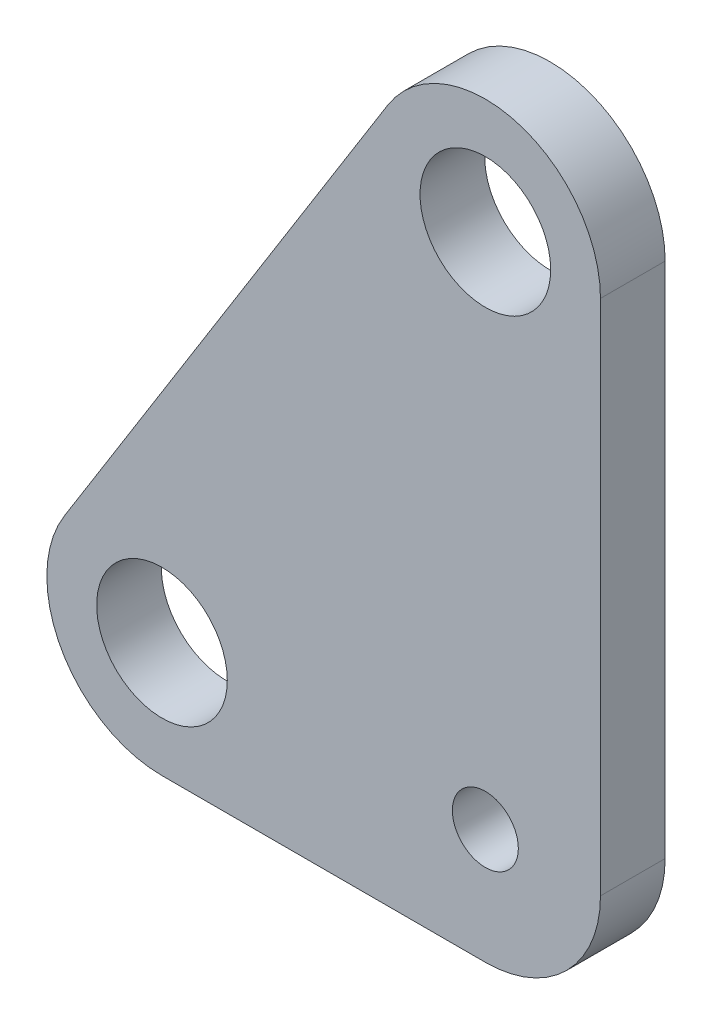
ISO-10303-21;
HEADER;
FILE_DESCRIPTION(('STEP AP214'),'2;1');
FILE_NAME('part.step','',(''),(''),'','','');
FILE_SCHEMA(('AUTOMOTIVE_DESIGN { 1 0 10303 214 1 1 1 1 }'));
ENDSEC;
DATA;
#1=APPLICATION_CONTEXT('core data for automotive mechanical design processes');
#2=APPLICATION_PROTOCOL_DEFINITION('international standard','automotive_design',2000,#1);
#3=PRODUCT_CONTEXT('',#1,'mechanical');
#4=PRODUCT('Part','Part','',(#3));
#5=PRODUCT_RELATED_PRODUCT_CATEGORY('part','',(#4));
#6=PRODUCT_DEFINITION_FORMATION('','',#4);
#7=PRODUCT_DEFINITION_CONTEXT('part definition',#1,'design');
#8=PRODUCT_DEFINITION('design','',#6,#7);
#9=PRODUCT_DEFINITION_SHAPE('','',#8);
#10=(LENGTH_UNIT() NAMED_UNIT(*) SI_UNIT(.MILLI.,.METRE.));
#11=(NAMED_UNIT(*) PLANE_ANGLE_UNIT() SI_UNIT($,.RADIAN.));
#12=(NAMED_UNIT(*) SI_UNIT($,.STERADIAN.) SOLID_ANGLE_UNIT());
#13=UNCERTAINTY_MEASURE_WITH_UNIT(LENGTH_MEASURE(1.E-05),#10,'distance_accuracy_value','');
#14=(GEOMETRIC_REPRESENTATION_CONTEXT(3) GLOBAL_UNCERTAINTY_ASSIGNED_CONTEXT((#13)) GLOBAL_UNIT_ASSIGNED_CONTEXT((#10,
#11,#12)) REPRESENTATION_CONTEXT('',''));
#15=CARTESIAN_POINT('',(0.,0.,0.));
#16=DIRECTION('',(0.,0.,1.));
#17=DIRECTION('',(1.,0.,0.));
#18=AXIS2_PLACEMENT_3D('',#15,#16,#17);
#19=CARTESIAN_POINT('',(-31.75,0.,6.35));
#20=DIRECTION('',(0.,0.,1.));
#21=DIRECTION('',(1.,0.,0.));
#22=AXIS2_PLACEMENT_3D('',#19,#20,#21);
#23=PLANE('',#22);
#24=CARTESIAN_POINT('',(-31.75,0.,6.35));
#25=DIRECTION('',(0.,0.,1.));
#26=DIRECTION('',(1.,0.,0.));
#27=AXIS2_PLACEMENT_3D('',#24,#25,#26);
#28=CIRCLE('',#27,6.4135);
#29=CARTESIAN_POINT('',(-25.3365,0.,6.35));
#30=VERTEX_POINT('',#29);
#31=EDGE_CURVE('E211',#30,#30,#28,.T.);
#32=ORIENTED_EDGE('',*,*,#31,.F.);
#33=EDGE_LOOP('',(#32));
#34=FACE_BOUND('',#33,.T.);
#35=CARTESIAN_POINT('',(-31.75,0.,6.35));
#36=DIRECTION('',(0.,0.,1.));
#37=DIRECTION('',(1.,0.,0.));
#38=AXIS2_PLACEMENT_3D('',#35,#36,#37);
#39=CIRCLE('',#38,11.303);
#40=CARTESIAN_POINT('',(-41.3349248301695,5.99057801885595,6.35));
#41=VERTEX_POINT('',#40);
#42=CARTESIAN_POINT('',(-31.75,-11.303,6.35));
#43=VERTEX_POINT('',#42);
#44=EDGE_CURVE('E150',#41,#43,#39,.T.);
#45=ORIENTED_EDGE('',*,*,#44,.T.);
#46=DIRECTION('',(1.,0.,0.));
#47=VECTOR('',#46,1.);
#48=CARTESIAN_POINT('',(-31.75,-11.303,6.35));
#49=LINE('',#48,#47);
#50=CARTESIAN_POINT('',(0.,-11.303,6.35));
#51=VERTEX_POINT('',#50);
#52=EDGE_CURVE('E98',#43,#51,#49,.T.);
#53=ORIENTED_EDGE('',*,*,#52,.T.);
#54=CARTESIAN_POINT('',(0.,0.,6.35));
#55=DIRECTION('',(0.,0.,1.));
#56=DIRECTION('',(1.,0.,0.));
#57=AXIS2_PLACEMENT_3D('',#54,#55,#56);
#58=CIRCLE('',#57,11.303);
#59=CARTESIAN_POINT('',(11.303,0.,6.35));
#60=VERTEX_POINT('',#59);
#61=EDGE_CURVE('E111',#51,#60,#58,.T.);
#62=ORIENTED_EDGE('',*,*,#61,.T.);
#63=DIRECTION('',(0.,1.,0.));
#64=VECTOR('',#63,1.);
#65=CARTESIAN_POINT('',(11.303,0.,6.35));
#66=LINE('',#65,#64);
#67=CARTESIAN_POINT('',(11.303,50.8,6.35));
#68=VERTEX_POINT('',#67);
#69=EDGE_CURVE('E105',#60,#68,#66,.T.);
#70=ORIENTED_EDGE('',*,*,#69,.T.);
#71=CARTESIAN_POINT('',(0.,50.8,6.35));
#72=DIRECTION('',(0.,0.,1.));
#73=DIRECTION('',(1.,0.,0.));
#74=AXIS2_PLACEMENT_3D('',#71,#72,#73);
#75=CIRCLE('',#74,11.303);
#76=CARTESIAN_POINT('',(-9.58492483016951,56.7905780188559,6.35));
#77=VERTEX_POINT('',#76);
#78=EDGE_CURVE('E109',#68,#77,#75,.T.);
#79=ORIENTED_EDGE('',*,*,#78,.T.);
#80=DIRECTION('',(-0.52999894000318,-0.847998304005088,0.));
#81=VECTOR('',#80,1.);
#82=CARTESIAN_POINT('',(-41.3349248301695,5.99057801885595,6.35));
#83=LINE('',#82,#81);
#84=EDGE_CURVE('E61',#77,#41,#83,.T.);
#85=ORIENTED_EDGE('',*,*,#84,.T.);
#86=EDGE_LOOP('',(#45,#53,#62,#70,#79,#85));
#87=FACE_BOUND('',#86,.T.);
#88=CARTESIAN_POINT('',(0.,0.,6.35));
#89=DIRECTION('',(0.,0.,1.));
#90=DIRECTION('',(1.,0.,0.));
#91=AXIS2_PLACEMENT_3D('',#88,#89,#90);
#92=CIRCLE('',#91,3.2385);
#93=CARTESIAN_POINT('',(3.2385,0.,6.35));
#94=VERTEX_POINT('',#93);
#95=EDGE_CURVE('E138',#94,#94,#92,.T.);
#96=ORIENTED_EDGE('',*,*,#95,.F.);
#97=EDGE_LOOP('',(#96));
#98=FACE_BOUND('',#97,.T.);
#99=CARTESIAN_POINT('',(0.,50.8,6.35));
#100=DIRECTION('',(0.,0.,1.));
#101=DIRECTION('',(1.,0.,0.));
#102=AXIS2_PLACEMENT_3D('',#99,#100,#101);
#103=CIRCLE('',#102,6.4135);
#104=CARTESIAN_POINT('',(6.4135,50.8,6.35));
#105=VERTEX_POINT('',#104);
#106=EDGE_CURVE('E200',#105,#105,#103,.T.);
#107=ORIENTED_EDGE('',*,*,#106,.F.);
#108=EDGE_LOOP('',(#107));
#109=FACE_BOUND('',#108,.T.);
#110=ADVANCED_FACE('F43',(#34,#87,#98,#109),#23,.T.);
#111=CARTESIAN_POINT('',(-31.75,0.,0.));
#112=DIRECTION('',(0.,0.,1.));
#113=DIRECTION('',(1.,0.,0.));
#114=AXIS2_PLACEMENT_3D('',#111,#112,#113);
#115=PLANE('',#114);
#116=CARTESIAN_POINT('',(-31.75,0.,0.));
#117=DIRECTION('',(0.,0.,1.));
#118=DIRECTION('',(1.,0.,0.));
#119=AXIS2_PLACEMENT_3D('',#116,#117,#118);
#120=CIRCLE('',#119,11.303);
#121=CARTESIAN_POINT('',(-41.3349248301695,5.99057801885595,0.));
#122=VERTEX_POINT('',#121);
#123=CARTESIAN_POINT('',(-31.75,-11.303,0.));
#124=VERTEX_POINT('',#123);
#125=EDGE_CURVE('E133',#122,#124,#120,.T.);
#126=ORIENTED_EDGE('',*,*,#125,.F.);
#127=DIRECTION('',(-0.52999894000318,-0.847998304005088,0.));
#128=VECTOR('',#127,1.);
#129=CARTESIAN_POINT('',(-41.3349248301695,5.99057801885595,0.));
#130=LINE('',#129,#128);
#131=CARTESIAN_POINT('',(-9.58492483016951,56.7905780188559,0.));
#132=VERTEX_POINT('',#131);
#133=EDGE_CURVE('E90',#132,#122,#130,.T.);
#134=ORIENTED_EDGE('',*,*,#133,.F.);
#135=CARTESIAN_POINT('',(0.,50.8,0.));
#136=DIRECTION('',(0.,0.,1.));
#137=DIRECTION('',(1.,0.,0.));
#138=AXIS2_PLACEMENT_3D('',#135,#136,#137);
#139=CIRCLE('',#138,11.303);
#140=CARTESIAN_POINT('',(11.303,50.8,0.));
#141=VERTEX_POINT('',#140);
#142=EDGE_CURVE('E84',#141,#132,#139,.T.);
#143=ORIENTED_EDGE('',*,*,#142,.F.);
#144=DIRECTION('',(0.,1.,0.));
#145=VECTOR('',#144,1.);
#146=CARTESIAN_POINT('',(11.303,0.,0.));
#147=LINE('',#146,#145);
#148=CARTESIAN_POINT('',(11.303,0.,0.));
#149=VERTEX_POINT('',#148);
#150=EDGE_CURVE('E120',#149,#141,#147,.T.);
#151=ORIENTED_EDGE('',*,*,#150,.F.);
#152=CARTESIAN_POINT('',(0.,0.,0.));
#153=DIRECTION('',(0.,0.,1.));
#154=DIRECTION('',(1.,0.,0.));
#155=AXIS2_PLACEMENT_3D('',#152,#153,#154);
#156=CIRCLE('',#155,11.303);
#157=CARTESIAN_POINT('',(0.,-11.303,0.));
#158=VERTEX_POINT('',#157);
#159=EDGE_CURVE('E141',#158,#149,#156,.T.);
#160=ORIENTED_EDGE('',*,*,#159,.F.);
#161=DIRECTION('',(1.,0.,0.));
#162=VECTOR('',#161,1.);
#163=CARTESIAN_POINT('',(-31.75,-11.303,0.));
#164=LINE('',#163,#162);
#165=EDGE_CURVE('E137',#124,#158,#164,.T.);
#166=ORIENTED_EDGE('',*,*,#165,.F.);
#167=EDGE_LOOP('',(#126,#134,#143,#151,#160,#166));
#168=FACE_BOUND('',#167,.T.);
#169=CARTESIAN_POINT('',(0.,0.,0.));
#170=DIRECTION('',(0.,0.,1.));
#171=DIRECTION('',(1.,0.,0.));
#172=AXIS2_PLACEMENT_3D('',#169,#170,#171);
#173=CIRCLE('',#172,3.2385);
#174=CARTESIAN_POINT('',(3.2385,0.,0.));
#175=VERTEX_POINT('',#174);
#176=EDGE_CURVE('E215',#175,#175,#173,.T.);
#177=ORIENTED_EDGE('',*,*,#176,.T.);
#178=EDGE_LOOP('',(#177));
#179=FACE_BOUND('',#178,.T.);
#180=CARTESIAN_POINT('',(-31.75,0.,0.));
#181=DIRECTION('',(0.,0.,1.));
#182=DIRECTION('',(1.,0.,0.));
#183=AXIS2_PLACEMENT_3D('',#180,#181,#182);
#184=CIRCLE('',#183,6.4135);
#185=CARTESIAN_POINT('',(-25.3365,0.,0.));
#186=VERTEX_POINT('',#185);
#187=EDGE_CURVE('E208',#186,#186,#184,.T.);
#188=ORIENTED_EDGE('',*,*,#187,.T.);
#189=EDGE_LOOP('',(#188));
#190=FACE_BOUND('',#189,.T.);
#191=CARTESIAN_POINT('',(0.,50.8,0.));
#192=DIRECTION('',(0.,0.,1.));
#193=DIRECTION('',(1.,0.,0.));
#194=AXIS2_PLACEMENT_3D('',#191,#192,#193);
#195=CIRCLE('',#194,6.4135);
#196=CARTESIAN_POINT('',(6.4135,50.8,0.));
#197=VERTEX_POINT('',#196);
#198=EDGE_CURVE('E203',#197,#197,#195,.T.);
#199=ORIENTED_EDGE('',*,*,#198,.T.);
#200=EDGE_LOOP('',(#199));
#201=FACE_BOUND('',#200,.T.);
#202=ADVANCED_FACE('F163',(#168,#179,#190,#201),#115,.F.);
#203=CARTESIAN_POINT('',(-31.75,0.,6.35));
#204=DIRECTION('',(0.,0.,-1.));
#205=DIRECTION('',(-1.,0.,0.));
#206=AXIS2_PLACEMENT_3D('',#203,#204,#205);
#207=CYLINDRICAL_SURFACE('',#206,11.303);
#208=ORIENTED_EDGE('',*,*,#125,.T.);
#209=DIRECTION('',(0.,0.,-1.));
#210=VECTOR('',#209,1.);
#211=CARTESIAN_POINT('',(-31.75,-11.303,6.35));
#212=LINE('',#211,#210);
#213=EDGE_CURVE('E11',#43,#124,#212,.T.);
#214=ORIENTED_EDGE('',*,*,#213,.F.);
#215=ORIENTED_EDGE('',*,*,#44,.F.);
#216=DIRECTION('',(0.,0.,-1.));
#217=VECTOR('',#216,1.);
#218=CARTESIAN_POINT('',(-41.3349248301695,5.99057801885595,6.35));
#219=LINE('',#218,#217);
#220=EDGE_CURVE('E129',#41,#122,#219,.T.);
#221=ORIENTED_EDGE('',*,*,#220,.T.);
#222=EDGE_LOOP('',(#208,#214,#215,#221));
#223=FACE_BOUND('',#222,.T.);
#224=ADVANCED_FACE('F45',(#223),#207,.T.);
#225=CARTESIAN_POINT('',(-31.75,-11.303,6.35));
#226=DIRECTION('',(0.,1.,0.));
#227=DIRECTION('',(0.,0.,1.));
#228=AXIS2_PLACEMENT_3D('',#225,#226,#227);
#229=PLANE('',#228);
#230=ORIENTED_EDGE('',*,*,#165,.T.);
#231=DIRECTION('',(0.,0.,-1.));
#232=VECTOR('',#231,1.);
#233=CARTESIAN_POINT('',(0.,-11.303,6.35));
#234=LINE('',#233,#232);
#235=EDGE_CURVE('E53',#51,#158,#234,.T.);
#236=ORIENTED_EDGE('',*,*,#235,.F.);
#237=ORIENTED_EDGE('',*,*,#52,.F.);
#238=ORIENTED_EDGE('',*,*,#213,.T.);
#239=EDGE_LOOP('',(#230,#236,#237,#238));
#240=FACE_BOUND('',#239,.T.);
#241=ADVANCED_FACE('F275',(#240),#229,.F.);
#242=CARTESIAN_POINT('',(0.,0.,6.35));
#243=DIRECTION('',(0.,0.,-1.));
#244=DIRECTION('',(-1.,0.,0.));
#245=AXIS2_PLACEMENT_3D('',#242,#243,#244);
#246=CYLINDRICAL_SURFACE('',#245,11.303);
#247=ORIENTED_EDGE('',*,*,#159,.T.);
#248=DIRECTION('',(0.,0.,-1.));
#249=VECTOR('',#248,1.);
#250=CARTESIAN_POINT('',(11.303,0.,6.35));
#251=LINE('',#250,#249);
#252=EDGE_CURVE('E122',#60,#149,#251,.T.);
#253=ORIENTED_EDGE('',*,*,#252,.F.);
#254=ORIENTED_EDGE('',*,*,#61,.F.);
#255=ORIENTED_EDGE('',*,*,#235,.T.);
#256=EDGE_LOOP('',(#247,#253,#254,#255));
#257=FACE_BOUND('',#256,.T.);
#258=ADVANCED_FACE('F160',(#257),#246,.T.);
#259=CARTESIAN_POINT('',(11.303,0.,6.35));
#260=DIRECTION('',(-1.,0.,0.));
#261=DIRECTION('',(0.,-1.,0.));
#262=AXIS2_PLACEMENT_3D('',#259,#260,#261);
#263=PLANE('',#262);
#264=ORIENTED_EDGE('',*,*,#150,.T.);
#265=DIRECTION('',(0.,0.,-1.));
#266=VECTOR('',#265,1.);
#267=CARTESIAN_POINT('',(11.303,50.8,6.35));
#268=LINE('',#267,#266);
#269=EDGE_CURVE('E117',#68,#141,#268,.T.);
#270=ORIENTED_EDGE('',*,*,#269,.F.);
#271=ORIENTED_EDGE('',*,*,#69,.F.);
#272=ORIENTED_EDGE('',*,*,#252,.T.);
#273=EDGE_LOOP('',(#264,#270,#271,#272));
#274=FACE_BOUND('',#273,.T.);
#275=ADVANCED_FACE('F118',(#274),#263,.F.);
#276=CARTESIAN_POINT('',(0.,50.8,6.35));
#277=DIRECTION('',(0.,0.,-1.));
#278=DIRECTION('',(-1.,0.,0.));
#279=AXIS2_PLACEMENT_3D('',#276,#277,#278);
#280=CYLINDRICAL_SURFACE('',#279,11.303);
#281=ORIENTED_EDGE('',*,*,#142,.T.);
#282=DIRECTION('',(0.,0.,-1.));
#283=VECTOR('',#282,1.);
#284=CARTESIAN_POINT('',(-9.58492483016951,56.7905780188559,6.35));
#285=LINE('',#284,#283);
#286=EDGE_CURVE('E123',#77,#132,#285,.T.);
#287=ORIENTED_EDGE('',*,*,#286,.F.);
#288=ORIENTED_EDGE('',*,*,#78,.F.);
#289=ORIENTED_EDGE('',*,*,#269,.T.);
#290=EDGE_LOOP('',(#281,#287,#288,#289));
#291=FACE_BOUND('',#290,.T.);
#292=ADVANCED_FACE('F125',(#291),#280,.T.);
#293=CARTESIAN_POINT('',(-41.3349248301695,5.99057801885595,6.35));
#294=DIRECTION('',(0.847998304005088,-0.52999894000318,0.));
#295=DIRECTION('',(0.52999894000318,0.847998304005088,0.));
#296=AXIS2_PLACEMENT_3D('',#293,#294,#295);
#297=PLANE('',#296);
#298=ORIENTED_EDGE('',*,*,#133,.T.);
#299=ORIENTED_EDGE('',*,*,#220,.F.);
#300=ORIENTED_EDGE('',*,*,#84,.F.);
#301=ORIENTED_EDGE('',*,*,#286,.T.);
#302=EDGE_LOOP('',(#298,#299,#300,#301));
#303=FACE_BOUND('',#302,.T.);
#304=ADVANCED_FACE('F168',(#303),#297,.F.);
#305=CARTESIAN_POINT('',(0.,0.,6.35));
#306=DIRECTION('',(0.,0.,-1.));
#307=DIRECTION('',(-1.,0.,0.));
#308=AXIS2_PLACEMENT_3D('',#305,#306,#307);
#309=CYLINDRICAL_SURFACE('',#308,3.2385);
#310=ORIENTED_EDGE('',*,*,#95,.T.);
#311=EDGE_LOOP('',(#310));
#312=FACE_BOUND('',#311,.T.);
#313=ORIENTED_EDGE('',*,*,#176,.F.);
#314=EDGE_LOOP('',(#313));
#315=FACE_BOUND('',#314,.T.);
#316=ADVANCED_FACE('F170',(#312,#315),#309,.F.);
#317=CARTESIAN_POINT('',(-31.75,0.,6.35));
#318=DIRECTION('',(0.,0.,-1.));
#319=DIRECTION('',(-1.,0.,0.));
#320=AXIS2_PLACEMENT_3D('',#317,#318,#319);
#321=CYLINDRICAL_SURFACE('',#320,6.4135);
#322=ORIENTED_EDGE('',*,*,#31,.T.);
#323=EDGE_LOOP('',(#322));
#324=FACE_BOUND('',#323,.T.);
#325=ORIENTED_EDGE('',*,*,#187,.F.);
#326=EDGE_LOOP('',(#325));
#327=FACE_BOUND('',#326,.T.);
#328=ADVANCED_FACE('F176',(#324,#327),#321,.F.);
#329=CARTESIAN_POINT('',(0.,50.8,6.35));
#330=DIRECTION('',(0.,0.,-1.));
#331=DIRECTION('',(-1.,0.,0.));
#332=AXIS2_PLACEMENT_3D('',#329,#330,#331);
#333=CYLINDRICAL_SURFACE('',#332,6.4135);
#334=ORIENTED_EDGE('',*,*,#106,.T.);
#335=EDGE_LOOP('',(#334));
#336=FACE_BOUND('',#335,.T.);
#337=ORIENTED_EDGE('',*,*,#198,.F.);
#338=EDGE_LOOP('',(#337));
#339=FACE_BOUND('',#338,.T.);
#340=ADVANCED_FACE('F191',(#336,#339),#333,.F.);
#341=CLOSED_SHELL('',(#110,#202,#224,#241,#258,#275,#292,#304,#316,#328,#340));
#342=MANIFOLD_SOLID_BREP('B2',#341);
#343=ADVANCED_BREP_SHAPE_REPRESENTATION('',(#18,#342),#14);
#344=SHAPE_DEFINITION_REPRESENTATION(#9,#343);
ENDSEC;
END-ISO-10303-21;
